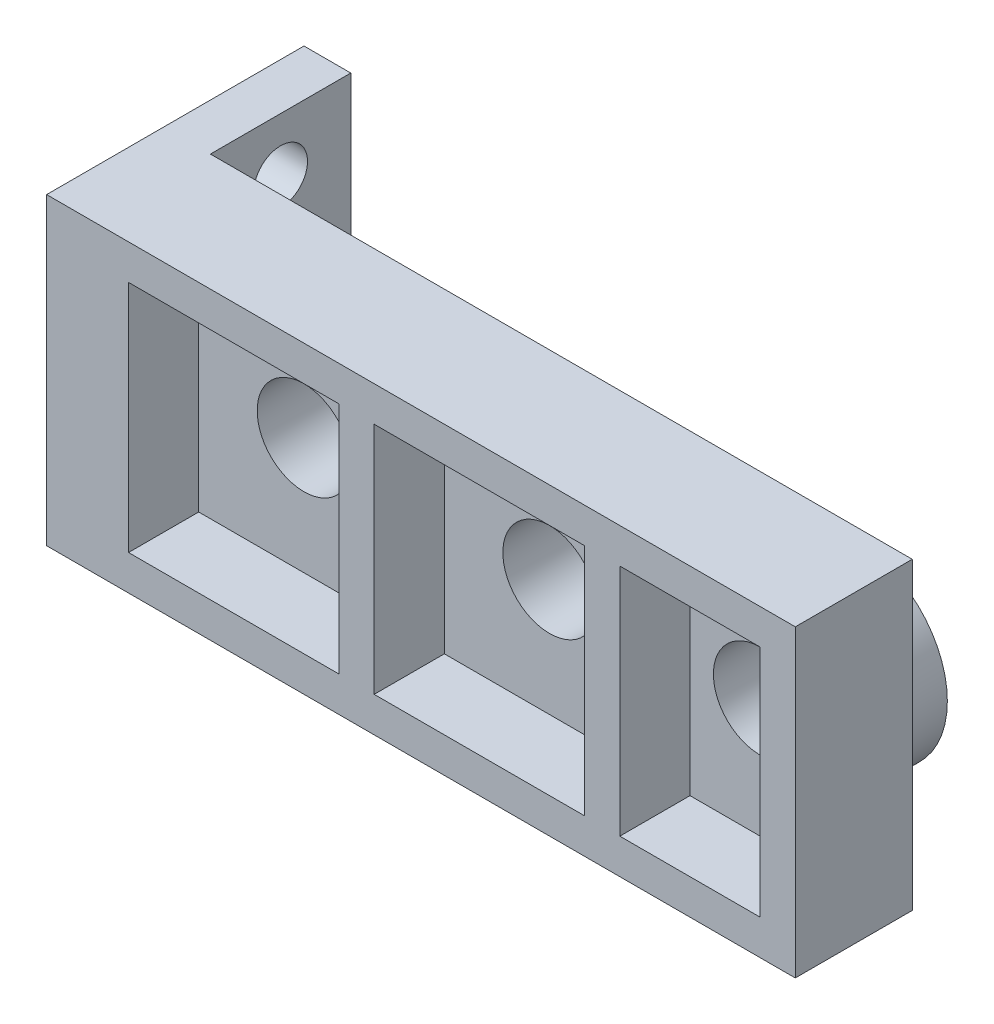
ISO-10303-21;
HEADER;
FILE_DESCRIPTION(('STEP AP214'),'2;1');
FILE_NAME('part.step','',(''),(''),'','','');
FILE_SCHEMA(('AUTOMOTIVE_DESIGN { 1 0 10303 214 1 1 1 1 }'));
ENDSEC;
DATA;
#1=APPLICATION_CONTEXT('core data for automotive mechanical design processes');
#2=APPLICATION_PROTOCOL_DEFINITION('international standard','automotive_design',2000,#1);
#3=PRODUCT_CONTEXT('',#1,'mechanical');
#4=PRODUCT('Part','Part','',(#3));
#5=PRODUCT_RELATED_PRODUCT_CATEGORY('part','',(#4));
#6=PRODUCT_DEFINITION_FORMATION('','',#4);
#7=PRODUCT_DEFINITION_CONTEXT('part definition',#1,'design');
#8=PRODUCT_DEFINITION('design','',#6,#7);
#9=PRODUCT_DEFINITION_SHAPE('','',#8);
#10=(LENGTH_UNIT() NAMED_UNIT(*) SI_UNIT(.MILLI.,.METRE.));
#11=(NAMED_UNIT(*) PLANE_ANGLE_UNIT() SI_UNIT($,.RADIAN.));
#12=(NAMED_UNIT(*) SI_UNIT($,.STERADIAN.) SOLID_ANGLE_UNIT());
#13=UNCERTAINTY_MEASURE_WITH_UNIT(LENGTH_MEASURE(1.E-05),#10,'distance_accuracy_value','');
#14=(GEOMETRIC_REPRESENTATION_CONTEXT(3) GLOBAL_UNCERTAINTY_ASSIGNED_CONTEXT((#13)) GLOBAL_UNIT_ASSIGNED_CONTEXT((#10,
#11,#12)) REPRESENTATION_CONTEXT('',''));
#15=CARTESIAN_POINT('',(0.,0.,0.));
#16=DIRECTION('',(0.,0.,1.));
#17=DIRECTION('',(1.,0.,0.));
#18=AXIS2_PLACEMENT_3D('',#15,#16,#17);
#19=CARTESIAN_POINT('',(0.,0.,0.));
#20=DIRECTION('',(0.,0.,1.));
#21=DIRECTION('',(1.,0.,0.));
#22=AXIS2_PLACEMENT_3D('',#19,#20,#21);
#23=PLANE('',#22);
#24=CARTESIAN_POINT('',(1.5,0.,0.));
#25=DIRECTION('',(0.,0.,1.));
#26=DIRECTION('',(1.,0.,0.));
#27=AXIS2_PLACEMENT_3D('',#24,#25,#26);
#28=CIRCLE('',#27,4.);
#29=CARTESIAN_POINT('',(5.5,0.,0.));
#30=VERTEX_POINT('',#29);
#31=EDGE_CURVE('E44',#30,#30,#28,.F.);
#32=ORIENTED_EDGE('',*,*,#31,.F.);
#33=EDGE_LOOP('',(#32));
#34=FACE_BOUND('',#33,.T.);
#35=DIRECTION('',(0.,1.,0.));
#36=VECTOR('',#35,1.);
#37=CARTESIAN_POINT('',(15.,6.5,0.));
#38=LINE('',#37,#36);
#39=CARTESIAN_POINT('',(15.,-6.5,0.));
#40=VERTEX_POINT('',#39);
#41=CARTESIAN_POINT('',(15.,6.5,0.));
#42=VERTEX_POINT('',#41);
#43=EDGE_CURVE('E241',#40,#42,#38,.T.);
#44=ORIENTED_EDGE('',*,*,#43,.F.);
#45=DIRECTION('',(1.,0.,0.));
#46=VECTOR('',#45,1.);
#47=CARTESIAN_POINT('',(-15.,-6.5,0.));
#48=LINE('',#47,#46);
#49=CARTESIAN_POINT('',(-15.,-6.5,0.));
#50=VERTEX_POINT('',#49);
#51=EDGE_CURVE('E307',#50,#40,#48,.T.);
#52=ORIENTED_EDGE('',*,*,#51,.F.);
#53=DIRECTION('',(0.,-1.,0.));
#54=VECTOR('',#53,1.);
#55=CARTESIAN_POINT('',(-15.,6.5,0.));
#56=LINE('',#55,#54);
#57=CARTESIAN_POINT('',(-15.,6.5,0.));
#58=VERTEX_POINT('',#57);
#59=EDGE_CURVE('E315',#58,#50,#56,.T.);
#60=ORIENTED_EDGE('',*,*,#59,.F.);
#61=DIRECTION('',(-1.,0.,0.));
#62=VECTOR('',#61,1.);
#63=CARTESIAN_POINT('',(-15.,6.5,0.));
#64=LINE('',#63,#62);
#65=EDGE_CURVE('E313',#42,#58,#64,.T.);
#66=ORIENTED_EDGE('',*,*,#65,.F.);
#67=EDGE_LOOP('',(#44,#52,#60,#66));
#68=FACE_BOUND('',#67,.T.);
#69=CARTESIAN_POINT('',(10.5,0.,0.));
#70=DIRECTION('',(0.,0.,1.));
#71=DIRECTION('',(1.,0.,0.));
#72=AXIS2_PLACEMENT_3D('',#69,#70,#71);
#73=CIRCLE('',#72,4.);
#74=CARTESIAN_POINT('',(14.5,0.,0.));
#75=VERTEX_POINT('',#74);
#76=EDGE_CURVE('E323',#75,#75,#73,.F.);
#77=ORIENTED_EDGE('',*,*,#76,.F.);
#78=EDGE_LOOP('',(#77));
#79=FACE_BOUND('',#78,.T.);
#80=CARTESIAN_POINT('',(-9.,0.,0.));
#81=DIRECTION('',(0.,0.,1.));
#82=DIRECTION('',(1.,0.,0.));
#83=AXIS2_PLACEMENT_3D('',#80,#81,#82);
#84=CIRCLE('',#83,4.);
#85=CARTESIAN_POINT('',(-5.,0.,0.));
#86=VERTEX_POINT('',#85);
#87=EDGE_CURVE('E11',#86,#86,#84,.F.);
#88=ORIENTED_EDGE('',*,*,#87,.F.);
#89=EDGE_LOOP('',(#88));
#90=FACE_BOUND('',#89,.T.);
#91=ADVANCED_FACE('F36',(#34,#68,#79,#90),#23,.F.);
#92=CARTESIAN_POINT('',(15.,6.5,5.));
#93=DIRECTION('',(-1.,0.,0.));
#94=DIRECTION('',(0.,0.,1.));
#95=AXIS2_PLACEMENT_3D('',#92,#93,#94);
#96=PLANE('',#95);
#97=ORIENTED_EDGE('',*,*,#43,.T.);
#98=DIRECTION('',(0.,0.,-1.));
#99=VECTOR('',#98,1.);
#100=CARTESIAN_POINT('',(15.,6.5,5.));
#101=LINE('',#100,#99);
#102=CARTESIAN_POINT('',(15.,6.5,5.));
#103=VERTEX_POINT('',#102);
#104=EDGE_CURVE('E321',#103,#42,#101,.T.);
#105=ORIENTED_EDGE('',*,*,#104,.F.);
#106=DIRECTION('',(0.,1.,0.));
#107=VECTOR('',#106,1.);
#108=CARTESIAN_POINT('',(15.,6.5,5.));
#109=LINE('',#108,#107);
#110=CARTESIAN_POINT('',(15.,-6.5,5.));
#111=VERTEX_POINT('',#110);
#112=EDGE_CURVE('E167',#111,#103,#109,.T.);
#113=ORIENTED_EDGE('',*,*,#112,.F.);
#114=DIRECTION('',(0.,0.,-1.));
#115=VECTOR('',#114,1.);
#116=CARTESIAN_POINT('',(15.,-6.5,5.));
#117=LINE('',#116,#115);
#118=EDGE_CURVE('E310',#111,#40,#117,.T.);
#119=ORIENTED_EDGE('',*,*,#118,.T.);
#120=EDGE_LOOP('',(#97,#105,#113,#119));
#121=FACE_BOUND('',#120,.T.);
#122=ADVANCED_FACE('F38',(#121),#96,.F.);
#123=CARTESIAN_POINT('',(-15.,6.5,5.));
#124=DIRECTION('',(0.,-1.,0.));
#125=DIRECTION('',(0.,0.,-1.));
#126=AXIS2_PLACEMENT_3D('',#123,#124,#125);
#127=PLANE('',#126);
#128=ORIENTED_EDGE('',*,*,#65,.T.);
#129=DIRECTION('',(0.,0.,-1.));
#130=VECTOR('',#129,1.);
#131=CARTESIAN_POINT('',(-15.,6.5,5.));
#132=LINE('',#131,#130);
#133=CARTESIAN_POINT('',(-15.,6.5,-6.));
#134=VERTEX_POINT('',#133);
#135=EDGE_CURVE('E198',#58,#134,#132,.T.);
#136=ORIENTED_EDGE('',*,*,#135,.T.);
#137=DIRECTION('',(1.,0.,0.));
#138=VECTOR('',#137,1.);
#139=CARTESIAN_POINT('',(-17.,6.5,-6.));
#140=LINE('',#139,#138);
#141=CARTESIAN_POINT('',(-17.,6.5,-6.));
#142=VERTEX_POINT('',#141);
#143=EDGE_CURVE('E177',#142,#134,#140,.T.);
#144=ORIENTED_EDGE('',*,*,#143,.F.);
#145=DIRECTION('',(0.,0.,-1.));
#146=VECTOR('',#145,1.);
#147=CARTESIAN_POINT('',(-17.,6.5,5.));
#148=LINE('',#147,#146);
#149=CARTESIAN_POINT('',(-17.,6.5,5.));
#150=VERTEX_POINT('',#149);
#151=EDGE_CURVE('E174',#150,#142,#148,.T.);
#152=ORIENTED_EDGE('',*,*,#151,.F.);
#153=DIRECTION('',(-1.,0.,0.));
#154=VECTOR('',#153,1.);
#155=CARTESIAN_POINT('',(-15.,6.5,5.));
#156=LINE('',#155,#154);
#157=EDGE_CURVE('E161',#103,#150,#156,.T.);
#158=ORIENTED_EDGE('',*,*,#157,.F.);
#159=ORIENTED_EDGE('',*,*,#104,.T.);
#160=EDGE_LOOP('',(#128,#136,#144,#152,#158,#159));
#161=FACE_BOUND('',#160,.T.);
#162=ADVANCED_FACE('F175',(#161),#127,.F.);
#163=CARTESIAN_POINT('',(-15.,-6.5,5.));
#164=DIRECTION('',(0.,1.,0.));
#165=DIRECTION('',(0.,0.,1.));
#166=AXIS2_PLACEMENT_3D('',#163,#164,#165);
#167=PLANE('',#166);
#168=ORIENTED_EDGE('',*,*,#51,.T.);
#169=ORIENTED_EDGE('',*,*,#118,.F.);
#170=DIRECTION('',(1.,0.,0.));
#171=VECTOR('',#170,1.);
#172=CARTESIAN_POINT('',(-15.,-6.5,5.));
#173=LINE('',#172,#171);
#174=CARTESIAN_POINT('',(-17.,-6.5,5.));
#175=VERTEX_POINT('',#174);
#176=EDGE_CURVE('E171',#175,#111,#173,.T.);
#177=ORIENTED_EDGE('',*,*,#176,.F.);
#178=DIRECTION('',(0.,0.,1.));
#179=VECTOR('',#178,1.);
#180=CARTESIAN_POINT('',(-17.,-6.5,5.));
#181=LINE('',#180,#179);
#182=CARTESIAN_POINT('',(-17.,-6.5,-6.));
#183=VERTEX_POINT('',#182);
#184=EDGE_CURVE('E185',#183,#175,#181,.T.);
#185=ORIENTED_EDGE('',*,*,#184,.F.);
#186=DIRECTION('',(1.,0.,0.));
#187=VECTOR('',#186,1.);
#188=CARTESIAN_POINT('',(-17.,-6.5,-6.));
#189=LINE('',#188,#187);
#190=CARTESIAN_POINT('',(-15.,-6.5,-6.));
#191=VERTEX_POINT('',#190);
#192=EDGE_CURVE('E197',#183,#191,#189,.T.);
#193=ORIENTED_EDGE('',*,*,#192,.T.);
#194=DIRECTION('',(0.,0.,1.));
#195=VECTOR('',#194,1.);
#196=CARTESIAN_POINT('',(-15.,-6.5,5.));
#197=LINE('',#196,#195);
#198=EDGE_CURVE('E186',#191,#50,#197,.T.);
#199=ORIENTED_EDGE('',*,*,#198,.T.);
#200=EDGE_LOOP('',(#168,#169,#177,#185,#193,#199));
#201=FACE_BOUND('',#200,.T.);
#202=ADVANCED_FACE('F456',(#201),#167,.F.);
#203=CARTESIAN_POINT('',(0.,0.,5.));
#204=DIRECTION('',(0.,0.,1.));
#205=DIRECTION('',(1.,0.,0.));
#206=AXIS2_PLACEMENT_3D('',#203,#204,#205);
#207=PLANE('',#206);
#208=DIRECTION('',(0.,-1.,0.));
#209=VECTOR('',#208,1.);
#210=CARTESIAN_POINT('',(-13.5,5.,5.));
#211=LINE('',#210,#209);
#212=CARTESIAN_POINT('',(-13.5,5.,5.));
#213=VERTEX_POINT('',#212);
#214=CARTESIAN_POINT('',(-13.5,-5.,5.));
#215=VERTEX_POINT('',#214);
#216=EDGE_CURVE('E51',#213,#215,#211,.T.);
#217=ORIENTED_EDGE('',*,*,#216,.F.);
#218=DIRECTION('',(-1.,0.,0.));
#219=VECTOR('',#218,1.);
#220=CARTESIAN_POINT('',(-13.5,5.,5.));
#221=LINE('',#220,#219);
#222=CARTESIAN_POINT('',(-4.5,5.,5.));
#223=VERTEX_POINT('',#222);
#224=EDGE_CURVE('E219',#223,#213,#221,.T.);
#225=ORIENTED_EDGE('',*,*,#224,.F.);
#226=DIRECTION('',(0.,1.,0.));
#227=VECTOR('',#226,1.);
#228=CARTESIAN_POINT('',(-4.5,5.,5.));
#229=LINE('',#228,#227);
#230=CARTESIAN_POINT('',(-4.5,-5.,5.));
#231=VERTEX_POINT('',#230);
#232=EDGE_CURVE('E234',#231,#223,#229,.T.);
#233=ORIENTED_EDGE('',*,*,#232,.F.);
#234=DIRECTION('',(1.,0.,0.));
#235=VECTOR('',#234,1.);
#236=CARTESIAN_POINT('',(-13.5,-5.,5.));
#237=LINE('',#236,#235);
#238=EDGE_CURVE('E230',#215,#231,#237,.T.);
#239=ORIENTED_EDGE('',*,*,#238,.F.);
#240=EDGE_LOOP('',(#217,#225,#233,#239));
#241=FACE_BOUND('',#240,.T.);
#242=DIRECTION('',(0.,-1.,0.));
#243=VECTOR('',#242,1.);
#244=CARTESIAN_POINT('',(-3.,5.,5.));
#245=LINE('',#244,#243);
#246=CARTESIAN_POINT('',(-3.,5.,5.));
#247=VERTEX_POINT('',#246);
#248=CARTESIAN_POINT('',(-3.,-5.,5.));
#249=VERTEX_POINT('',#248);
#250=EDGE_CURVE('E59',#247,#249,#245,.T.);
#251=ORIENTED_EDGE('',*,*,#250,.F.);
#252=DIRECTION('',(-1.,0.,0.));
#253=VECTOR('',#252,1.);
#254=CARTESIAN_POINT('',(-3.,5.,5.));
#255=LINE('',#254,#253);
#256=CARTESIAN_POINT('',(6.,5.,5.));
#257=VERTEX_POINT('',#256);
#258=EDGE_CURVE('E251',#257,#247,#255,.T.);
#259=ORIENTED_EDGE('',*,*,#258,.F.);
#260=DIRECTION('',(0.,1.,0.));
#261=VECTOR('',#260,1.);
#262=CARTESIAN_POINT('',(6.,5.,5.));
#263=LINE('',#262,#261);
#264=CARTESIAN_POINT('',(6.,-5.,5.));
#265=VERTEX_POINT('',#264);
#266=EDGE_CURVE('E266',#265,#257,#263,.T.);
#267=ORIENTED_EDGE('',*,*,#266,.F.);
#268=DIRECTION('',(1.,0.,0.));
#269=VECTOR('',#268,1.);
#270=CARTESIAN_POINT('',(-3.,-5.,5.));
#271=LINE('',#270,#269);
#272=EDGE_CURVE('E262',#249,#265,#271,.T.);
#273=ORIENTED_EDGE('',*,*,#272,.F.);
#274=EDGE_LOOP('',(#251,#259,#267,#273));
#275=FACE_BOUND('',#274,.T.);
#276=DIRECTION('',(0.,-1.,0.));
#277=VECTOR('',#276,1.);
#278=CARTESIAN_POINT('',(7.5,5.,5.));
#279=LINE('',#278,#277);
#280=CARTESIAN_POINT('',(7.5,5.,5.));
#281=VERTEX_POINT('',#280);
#282=CARTESIAN_POINT('',(7.5,-5.,5.));
#283=VERTEX_POINT('',#282);
#284=EDGE_CURVE('E209',#281,#283,#279,.T.);
#285=ORIENTED_EDGE('',*,*,#284,.F.);
#286=DIRECTION('',(-1.,0.,0.));
#287=VECTOR('',#286,1.);
#288=CARTESIAN_POINT('',(7.5,5.,5.));
#289=LINE('',#288,#287);
#290=CARTESIAN_POINT('',(13.5,5.,5.));
#291=VERTEX_POINT('',#290);
#292=EDGE_CURVE('E281',#291,#281,#289,.T.);
#293=ORIENTED_EDGE('',*,*,#292,.F.);
#294=DIRECTION('',(0.,1.,0.));
#295=VECTOR('',#294,1.);
#296=CARTESIAN_POINT('',(13.5,5.,5.));
#297=LINE('',#296,#295);
#298=CARTESIAN_POINT('',(13.5,-5.,5.));
#299=VERTEX_POINT('',#298);
#300=EDGE_CURVE('E295',#299,#291,#297,.T.);
#301=ORIENTED_EDGE('',*,*,#300,.F.);
#302=DIRECTION('',(1.,0.,0.));
#303=VECTOR('',#302,1.);
#304=CARTESIAN_POINT('',(7.5,-5.,5.));
#305=LINE('',#304,#303);
#306=EDGE_CURVE('E292',#283,#299,#305,.T.);
#307=ORIENTED_EDGE('',*,*,#306,.F.);
#308=EDGE_LOOP('',(#285,#293,#301,#307));
#309=FACE_BOUND('',#308,.T.);
#310=ORIENTED_EDGE('',*,*,#112,.T.);
#311=ORIENTED_EDGE('',*,*,#157,.T.);
#312=DIRECTION('',(0.,1.,0.));
#313=VECTOR('',#312,1.);
#314=CARTESIAN_POINT('',(-17.,6.5,5.));
#315=LINE('',#314,#313);
#316=EDGE_CURVE('E165',#175,#150,#315,.T.);
#317=ORIENTED_EDGE('',*,*,#316,.F.);
#318=ORIENTED_EDGE('',*,*,#176,.T.);
#319=EDGE_LOOP('',(#310,#311,#317,#318));
#320=FACE_BOUND('',#319,.T.);
#321=ADVANCED_FACE('F163',(#241,#275,#309,#320),#207,.T.);
#322=CARTESIAN_POINT('',(7.5,5.,2.));
#323=DIRECTION('',(-1.,0.,0.));
#324=DIRECTION('',(0.,-1.,0.));
#325=AXIS2_PLACEMENT_3D('',#322,#323,#324);
#326=PLANE('',#325);
#327=ORIENTED_EDGE('',*,*,#284,.T.);
#328=DIRECTION('',(0.,0.,1.));
#329=VECTOR('',#328,1.);
#330=CARTESIAN_POINT('',(7.5,-5.,2.));
#331=LINE('',#330,#329);
#332=CARTESIAN_POINT('',(7.5,-5.,2.));
#333=VERTEX_POINT('',#332);
#334=EDGE_CURVE('E290',#333,#283,#331,.T.);
#335=ORIENTED_EDGE('',*,*,#334,.F.);
#336=DIRECTION('',(0.,-1.,0.));
#337=VECTOR('',#336,1.);
#338=CARTESIAN_POINT('',(7.5,5.,2.));
#339=LINE('',#338,#337);
#340=CARTESIAN_POINT('',(7.5,5.,2.));
#341=VERTEX_POINT('',#340);
#342=EDGE_CURVE('E277',#341,#333,#339,.T.);
#343=ORIENTED_EDGE('',*,*,#342,.F.);
#344=DIRECTION('',(0.,0.,1.));
#345=VECTOR('',#344,1.);
#346=CARTESIAN_POINT('',(7.5,5.,2.));
#347=LINE('',#346,#345);
#348=EDGE_CURVE('E263',#341,#281,#347,.T.);
#349=ORIENTED_EDGE('',*,*,#348,.T.);
#350=EDGE_LOOP('',(#327,#335,#343,#349));
#351=FACE_BOUND('',#350,.T.);
#352=ADVANCED_FACE('F444',(#351),#326,.F.);
#353=CARTESIAN_POINT('',(7.5,5.,2.));
#354=DIRECTION('',(0.,1.,0.));
#355=DIRECTION('',(0.,0.,1.));
#356=AXIS2_PLACEMENT_3D('',#353,#354,#355);
#357=PLANE('',#356);
#358=ORIENTED_EDGE('',*,*,#292,.T.);
#359=ORIENTED_EDGE('',*,*,#348,.F.);
#360=DIRECTION('',(-1.,0.,0.));
#361=VECTOR('',#360,1.);
#362=CARTESIAN_POINT('',(7.5,5.,2.));
#363=LINE('',#362,#361);
#364=CARTESIAN_POINT('',(13.5,5.,2.));
#365=VERTEX_POINT('',#364);
#366=EDGE_CURVE('E287',#365,#341,#363,.T.);
#367=ORIENTED_EDGE('',*,*,#366,.F.);
#368=DIRECTION('',(0.,0.,1.));
#369=VECTOR('',#368,1.);
#370=CARTESIAN_POINT('',(13.5,5.,2.));
#371=LINE('',#370,#369);
#372=EDGE_CURVE('E301',#365,#291,#371,.T.);
#373=ORIENTED_EDGE('',*,*,#372,.T.);
#374=EDGE_LOOP('',(#358,#359,#367,#373));
#375=FACE_BOUND('',#374,.T.);
#376=ADVANCED_FACE('F440',(#375),#357,.F.);
#377=CARTESIAN_POINT('',(13.5,5.,2.));
#378=DIRECTION('',(1.,0.,0.));
#379=DIRECTION('',(0.,1.,0.));
#380=AXIS2_PLACEMENT_3D('',#377,#378,#379);
#381=PLANE('',#380);
#382=ORIENTED_EDGE('',*,*,#300,.T.);
#383=ORIENTED_EDGE('',*,*,#372,.F.);
#384=DIRECTION('',(0.,1.,0.));
#385=VECTOR('',#384,1.);
#386=CARTESIAN_POINT('',(13.5,5.,2.));
#387=LINE('',#386,#385);
#388=CARTESIAN_POINT('',(13.5,-5.,2.));
#389=VERTEX_POINT('',#388);
#390=EDGE_CURVE('E284',#389,#365,#387,.T.);
#391=ORIENTED_EDGE('',*,*,#390,.F.);
#392=DIRECTION('',(0.,0.,1.));
#393=VECTOR('',#392,1.);
#394=CARTESIAN_POINT('',(13.5,-5.,2.));
#395=LINE('',#394,#393);
#396=EDGE_CURVE('E303',#389,#299,#395,.T.);
#397=ORIENTED_EDGE('',*,*,#396,.T.);
#398=EDGE_LOOP('',(#382,#383,#391,#397));
#399=FACE_BOUND('',#398,.T.);
#400=ADVANCED_FACE('F443',(#399),#381,.F.);
#401=CARTESIAN_POINT('',(7.5,-5.,2.));
#402=DIRECTION('',(0.,-1.,0.));
#403=DIRECTION('',(0.,0.,-1.));
#404=AXIS2_PLACEMENT_3D('',#401,#402,#403);
#405=PLANE('',#404);
#406=ORIENTED_EDGE('',*,*,#306,.T.);
#407=ORIENTED_EDGE('',*,*,#396,.F.);
#408=DIRECTION('',(1.,0.,0.));
#409=VECTOR('',#408,1.);
#410=CARTESIAN_POINT('',(7.5,-5.,2.));
#411=LINE('',#410,#409);
#412=EDGE_CURVE('E280',#333,#389,#411,.T.);
#413=ORIENTED_EDGE('',*,*,#412,.F.);
#414=ORIENTED_EDGE('',*,*,#334,.T.);
#415=EDGE_LOOP('',(#406,#407,#413,#414));
#416=FACE_BOUND('',#415,.T.);
#417=ADVANCED_FACE('F438',(#416),#405,.F.);
#418=CARTESIAN_POINT('',(0.,0.,2.));
#419=DIRECTION('',(0.,0.,1.));
#420=DIRECTION('',(1.,0.,0.));
#421=AXIS2_PLACEMENT_3D('',#418,#419,#420);
#422=PLANE('',#421);
#423=CARTESIAN_POINT('',(10.5,0.,2.));
#424=DIRECTION('',(0.,0.,1.));
#425=DIRECTION('',(1.,0.,0.));
#426=AXIS2_PLACEMENT_3D('',#423,#424,#425);
#427=CIRCLE('',#426,2.);
#428=CARTESIAN_POINT('',(12.5,0.,2.));
#429=VERTEX_POINT('',#428);
#430=EDGE_CURVE('E205',#429,#429,#427,.T.);
#431=ORIENTED_EDGE('',*,*,#430,.F.);
#432=EDGE_LOOP('',(#431));
#433=FACE_BOUND('',#432,.T.);
#434=ORIENTED_EDGE('',*,*,#342,.T.);
#435=ORIENTED_EDGE('',*,*,#412,.T.);
#436=ORIENTED_EDGE('',*,*,#390,.T.);
#437=ORIENTED_EDGE('',*,*,#366,.T.);
#438=EDGE_LOOP('',(#434,#435,#436,#437));
#439=FACE_BOUND('',#438,.T.);
#440=ADVANCED_FACE('F435',(#433,#439),#422,.T.);
#441=CARTESIAN_POINT('',(-3.,5.,2.));
#442=DIRECTION('',(-1.,0.,0.));
#443=DIRECTION('',(0.,-1.,0.));
#444=AXIS2_PLACEMENT_3D('',#441,#442,#443);
#445=PLANE('',#444);
#446=ORIENTED_EDGE('',*,*,#250,.T.);
#447=DIRECTION('',(0.,0.,1.));
#448=VECTOR('',#447,1.);
#449=CARTESIAN_POINT('',(-3.,-5.,2.));
#450=LINE('',#449,#448);
#451=CARTESIAN_POINT('',(-3.,-5.,2.));
#452=VERTEX_POINT('',#451);
#453=EDGE_CURVE('E260',#452,#249,#450,.T.);
#454=ORIENTED_EDGE('',*,*,#453,.F.);
#455=DIRECTION('',(0.,-1.,0.));
#456=VECTOR('',#455,1.);
#457=CARTESIAN_POINT('',(-3.,5.,2.));
#458=LINE('',#457,#456);
#459=CARTESIAN_POINT('',(-3.,5.,2.));
#460=VERTEX_POINT('',#459);
#461=EDGE_CURVE('E247',#460,#452,#458,.T.);
#462=ORIENTED_EDGE('',*,*,#461,.F.);
#463=DIRECTION('',(0.,0.,1.));
#464=VECTOR('',#463,1.);
#465=CARTESIAN_POINT('',(-3.,5.,2.));
#466=LINE('',#465,#464);
#467=EDGE_CURVE('E231',#460,#247,#466,.T.);
#468=ORIENTED_EDGE('',*,*,#467,.T.);
#469=EDGE_LOOP('',(#446,#454,#462,#468));
#470=FACE_BOUND('',#469,.T.);
#471=ADVANCED_FACE('F425',(#470),#445,.F.);
#472=CARTESIAN_POINT('',(-3.,5.,2.));
#473=DIRECTION('',(0.,1.,0.));
#474=DIRECTION('',(0.,0.,1.));
#475=AXIS2_PLACEMENT_3D('',#472,#473,#474);
#476=PLANE('',#475);
#477=ORIENTED_EDGE('',*,*,#258,.T.);
#478=ORIENTED_EDGE('',*,*,#467,.F.);
#479=DIRECTION('',(-1.,0.,0.));
#480=VECTOR('',#479,1.);
#481=CARTESIAN_POINT('',(-3.,5.,2.));
#482=LINE('',#481,#480);
#483=CARTESIAN_POINT('',(6.,5.,2.));
#484=VERTEX_POINT('',#483);
#485=EDGE_CURVE('E257',#484,#460,#482,.T.);
#486=ORIENTED_EDGE('',*,*,#485,.F.);
#487=DIRECTION('',(0.,0.,1.));
#488=VECTOR('',#487,1.);
#489=CARTESIAN_POINT('',(6.,5.,2.));
#490=LINE('',#489,#488);
#491=EDGE_CURVE('E272',#484,#257,#490,.T.);
#492=ORIENTED_EDGE('',*,*,#491,.T.);
#493=EDGE_LOOP('',(#477,#478,#486,#492));
#494=FACE_BOUND('',#493,.T.);
#495=ADVANCED_FACE('F421',(#494),#476,.F.);
#496=CARTESIAN_POINT('',(6.,5.,2.));
#497=DIRECTION('',(1.,0.,0.));
#498=DIRECTION('',(0.,1.,0.));
#499=AXIS2_PLACEMENT_3D('',#496,#497,#498);
#500=PLANE('',#499);
#501=ORIENTED_EDGE('',*,*,#266,.T.);
#502=ORIENTED_EDGE('',*,*,#491,.F.);
#503=DIRECTION('',(0.,1.,0.));
#504=VECTOR('',#503,1.);
#505=CARTESIAN_POINT('',(6.,5.,2.));
#506=LINE('',#505,#504);
#507=CARTESIAN_POINT('',(6.,-5.,2.));
#508=VERTEX_POINT('',#507);
#509=EDGE_CURVE('E254',#508,#484,#506,.T.);
#510=ORIENTED_EDGE('',*,*,#509,.F.);
#511=DIRECTION('',(0.,0.,1.));
#512=VECTOR('',#511,1.);
#513=CARTESIAN_POINT('',(6.,-5.,2.));
#514=LINE('',#513,#512);
#515=EDGE_CURVE('E274',#508,#265,#514,.T.);
#516=ORIENTED_EDGE('',*,*,#515,.T.);
#517=EDGE_LOOP('',(#501,#502,#510,#516));
#518=FACE_BOUND('',#517,.T.);
#519=ADVANCED_FACE('F424',(#518),#500,.F.);
#520=CARTESIAN_POINT('',(-3.,-5.,2.));
#521=DIRECTION('',(0.,-1.,0.));
#522=DIRECTION('',(0.,0.,-1.));
#523=AXIS2_PLACEMENT_3D('',#520,#521,#522);
#524=PLANE('',#523);
#525=ORIENTED_EDGE('',*,*,#272,.T.);
#526=ORIENTED_EDGE('',*,*,#515,.F.);
#527=DIRECTION('',(1.,0.,0.));
#528=VECTOR('',#527,1.);
#529=CARTESIAN_POINT('',(-3.,-5.,2.));
#530=LINE('',#529,#528);
#531=EDGE_CURVE('E250',#452,#508,#530,.T.);
#532=ORIENTED_EDGE('',*,*,#531,.F.);
#533=ORIENTED_EDGE('',*,*,#453,.T.);
#534=EDGE_LOOP('',(#525,#526,#532,#533));
#535=FACE_BOUND('',#534,.T.);
#536=ADVANCED_FACE('F419',(#535),#524,.F.);
#537=CARTESIAN_POINT('',(0.,0.,2.));
#538=DIRECTION('',(0.,0.,1.));
#539=DIRECTION('',(1.,0.,0.));
#540=AXIS2_PLACEMENT_3D('',#537,#538,#539);
#541=PLANE('',#540);
#542=CARTESIAN_POINT('',(1.5,0.,2.));
#543=DIRECTION('',(0.,0.,1.));
#544=DIRECTION('',(1.,0.,0.));
#545=AXIS2_PLACEMENT_3D('',#542,#543,#544);
#546=CIRCLE('',#545,2.);
#547=CARTESIAN_POINT('',(3.5,0.,2.));
#548=VERTEX_POINT('',#547);
#549=EDGE_CURVE('E210',#548,#548,#546,.T.);
#550=ORIENTED_EDGE('',*,*,#549,.F.);
#551=EDGE_LOOP('',(#550));
#552=FACE_BOUND('',#551,.T.);
#553=ORIENTED_EDGE('',*,*,#461,.T.);
#554=ORIENTED_EDGE('',*,*,#531,.T.);
#555=ORIENTED_EDGE('',*,*,#509,.T.);
#556=ORIENTED_EDGE('',*,*,#485,.T.);
#557=EDGE_LOOP('',(#553,#554,#555,#556));
#558=FACE_BOUND('',#557,.T.);
#559=ADVANCED_FACE('F416',(#552,#558),#541,.T.);
#560=CARTESIAN_POINT('',(-13.5,5.,2.));
#561=DIRECTION('',(-1.,0.,0.));
#562=DIRECTION('',(0.,-1.,0.));
#563=AXIS2_PLACEMENT_3D('',#560,#561,#562);
#564=PLANE('',#563);
#565=ORIENTED_EDGE('',*,*,#216,.T.);
#566=DIRECTION('',(0.,0.,1.));
#567=VECTOR('',#566,1.);
#568=CARTESIAN_POINT('',(-13.5,-5.,2.));
#569=LINE('',#568,#567);
#570=CARTESIAN_POINT('',(-13.5,-5.,2.));
#571=VERTEX_POINT('',#570);
#572=EDGE_CURVE('E228',#571,#215,#569,.T.);
#573=ORIENTED_EDGE('',*,*,#572,.F.);
#574=DIRECTION('',(0.,-1.,0.));
#575=VECTOR('',#574,1.);
#576=CARTESIAN_POINT('',(-13.5,5.,2.));
#577=LINE('',#576,#575);
#578=CARTESIAN_POINT('',(-13.5,5.,2.));
#579=VERTEX_POINT('',#578);
#580=EDGE_CURVE('E215',#579,#571,#577,.T.);
#581=ORIENTED_EDGE('',*,*,#580,.F.);
#582=DIRECTION('',(0.,0.,1.));
#583=VECTOR('',#582,1.);
#584=CARTESIAN_POINT('',(-13.5,5.,2.));
#585=LINE('',#584,#583);
#586=EDGE_CURVE('E239',#579,#213,#585,.T.);
#587=ORIENTED_EDGE('',*,*,#586,.T.);
#588=EDGE_LOOP('',(#565,#573,#581,#587));
#589=FACE_BOUND('',#588,.T.);
#590=ADVANCED_FACE('F406',(#589),#564,.F.);
#591=CARTESIAN_POINT('',(-13.5,5.,2.));
#592=DIRECTION('',(0.,1.,0.));
#593=DIRECTION('',(0.,0.,1.));
#594=AXIS2_PLACEMENT_3D('',#591,#592,#593);
#595=PLANE('',#594);
#596=ORIENTED_EDGE('',*,*,#224,.T.);
#597=ORIENTED_EDGE('',*,*,#586,.F.);
#598=DIRECTION('',(-1.,0.,0.));
#599=VECTOR('',#598,1.);
#600=CARTESIAN_POINT('',(-13.5,5.,2.));
#601=LINE('',#600,#599);
#602=CARTESIAN_POINT('',(-4.5,5.,2.));
#603=VERTEX_POINT('',#602);
#604=EDGE_CURVE('E225',#603,#579,#601,.T.);
#605=ORIENTED_EDGE('',*,*,#604,.F.);
#606=DIRECTION('',(0.,0.,1.));
#607=VECTOR('',#606,1.);
#608=CARTESIAN_POINT('',(-4.5,5.,2.));
#609=LINE('',#608,#607);
#610=EDGE_CURVE('E242',#603,#223,#609,.T.);
#611=ORIENTED_EDGE('',*,*,#610,.T.);
#612=EDGE_LOOP('',(#596,#597,#605,#611));
#613=FACE_BOUND('',#612,.T.);
#614=ADVANCED_FACE('F402',(#613),#595,.F.);
#615=CARTESIAN_POINT('',(-4.5,5.,2.));
#616=DIRECTION('',(1.,0.,0.));
#617=DIRECTION('',(0.,1.,0.));
#618=AXIS2_PLACEMENT_3D('',#615,#616,#617);
#619=PLANE('',#618);
#620=ORIENTED_EDGE('',*,*,#232,.T.);
#621=ORIENTED_EDGE('',*,*,#610,.F.);
#622=DIRECTION('',(0.,1.,0.));
#623=VECTOR('',#622,1.);
#624=CARTESIAN_POINT('',(-4.5,5.,2.));
#625=LINE('',#624,#623);
#626=CARTESIAN_POINT('',(-4.5,-5.,2.));
#627=VERTEX_POINT('',#626);
#628=EDGE_CURVE('E222',#627,#603,#625,.T.);
#629=ORIENTED_EDGE('',*,*,#628,.F.);
#630=DIRECTION('',(0.,0.,1.));
#631=VECTOR('',#630,1.);
#632=CARTESIAN_POINT('',(-4.5,-5.,2.));
#633=LINE('',#632,#631);
#634=EDGE_CURVE('E244',#627,#231,#633,.T.);
#635=ORIENTED_EDGE('',*,*,#634,.T.);
#636=EDGE_LOOP('',(#620,#621,#629,#635));
#637=FACE_BOUND('',#636,.T.);
#638=ADVANCED_FACE('F405',(#637),#619,.F.);
#639=CARTESIAN_POINT('',(-13.5,-5.,2.));
#640=DIRECTION('',(0.,-1.,0.));
#641=DIRECTION('',(0.,0.,-1.));
#642=AXIS2_PLACEMENT_3D('',#639,#640,#641);
#643=PLANE('',#642);
#644=ORIENTED_EDGE('',*,*,#238,.T.);
#645=ORIENTED_EDGE('',*,*,#634,.F.);
#646=DIRECTION('',(1.,0.,0.));
#647=VECTOR('',#646,1.);
#648=CARTESIAN_POINT('',(-13.5,-5.,2.));
#649=LINE('',#648,#647);
#650=EDGE_CURVE('E218',#571,#627,#649,.T.);
#651=ORIENTED_EDGE('',*,*,#650,.F.);
#652=ORIENTED_EDGE('',*,*,#572,.T.);
#653=EDGE_LOOP('',(#644,#645,#651,#652));
#654=FACE_BOUND('',#653,.T.);
#655=ADVANCED_FACE('F400',(#654),#643,.F.);
#656=CARTESIAN_POINT('',(0.,0.,2.));
#657=DIRECTION('',(0.,0.,1.));
#658=DIRECTION('',(1.,0.,0.));
#659=AXIS2_PLACEMENT_3D('',#656,#657,#658);
#660=PLANE('',#659);
#661=CARTESIAN_POINT('',(-9.,0.,2.));
#662=DIRECTION('',(0.,0.,1.));
#663=DIRECTION('',(1.,0.,0.));
#664=AXIS2_PLACEMENT_3D('',#661,#662,#663);
#665=CIRCLE('',#664,2.);
#666=CARTESIAN_POINT('',(-7.,0.,2.));
#667=VERTEX_POINT('',#666);
#668=EDGE_CURVE('E206',#667,#667,#665,.T.);
#669=ORIENTED_EDGE('',*,*,#668,.F.);
#670=EDGE_LOOP('',(#669));
#671=FACE_BOUND('',#670,.T.);
#672=ORIENTED_EDGE('',*,*,#580,.T.);
#673=ORIENTED_EDGE('',*,*,#650,.T.);
#674=ORIENTED_EDGE('',*,*,#628,.T.);
#675=ORIENTED_EDGE('',*,*,#604,.T.);
#676=EDGE_LOOP('',(#672,#673,#674,#675));
#677=FACE_BOUND('',#676,.T.);
#678=ADVANCED_FACE('F396',(#671,#677),#660,.T.);
#679=CARTESIAN_POINT('',(10.5,0.,-3.));
#680=DIRECTION('',(0.,0.,1.));
#681=DIRECTION('',(1.,0.,0.));
#682=AXIS2_PLACEMENT_3D('',#679,#680,#681);
#683=CYLINDRICAL_SURFACE('',#682,2.);
#684=ORIENTED_EDGE('',*,*,#430,.T.);
#685=EDGE_LOOP('',(#684));
#686=FACE_BOUND('',#685,.T.);
#687=CARTESIAN_POINT('',(10.5,0.,-2.));
#688=DIRECTION('',(0.,0.,-1.));
#689=DIRECTION('',(-1.,0.,0.));
#690=AXIS2_PLACEMENT_3D('',#687,#688,#689);
#691=CIRCLE('',#690,2.);
#692=CARTESIAN_POINT('',(8.5,0.,-2.));
#693=VERTEX_POINT('',#692);
#694=EDGE_CURVE('E722',#693,#693,#691,.T.);
#695=ORIENTED_EDGE('',*,*,#694,.T.);
#696=EDGE_LOOP('',(#695));
#697=FACE_BOUND('',#696,.T.);
#698=ADVANCED_FACE('F392',(#686,#697),#683,.F.);
#699=CARTESIAN_POINT('',(1.5,0.,-3.));
#700=DIRECTION('',(0.,0.,1.));
#701=DIRECTION('',(1.,0.,0.));
#702=AXIS2_PLACEMENT_3D('',#699,#700,#701);
#703=CYLINDRICAL_SURFACE('',#702,2.);
#704=ORIENTED_EDGE('',*,*,#549,.T.);
#705=EDGE_LOOP('',(#704));
#706=FACE_BOUND('',#705,.T.);
#707=CARTESIAN_POINT('',(1.5,0.,-2.));
#708=DIRECTION('',(0.,0.,-1.));
#709=DIRECTION('',(-1.,0.,0.));
#710=AXIS2_PLACEMENT_3D('',#707,#708,#709);
#711=CIRCLE('',#710,2.);
#712=CARTESIAN_POINT('',(-0.500000000000004,0.,-2.));
#713=VERTEX_POINT('',#712);
#714=EDGE_CURVE('E730',#713,#713,#711,.T.);
#715=ORIENTED_EDGE('',*,*,#714,.T.);
#716=EDGE_LOOP('',(#715));
#717=FACE_BOUND('',#716,.T.);
#718=ADVANCED_FACE('F388',(#706,#717),#703,.F.);
#719=CARTESIAN_POINT('',(-9.,0.,-3.));
#720=DIRECTION('',(0.,0.,1.));
#721=DIRECTION('',(1.,0.,0.));
#722=AXIS2_PLACEMENT_3D('',#719,#720,#721);
#723=CYLINDRICAL_SURFACE('',#722,2.);
#724=ORIENTED_EDGE('',*,*,#668,.T.);
#725=EDGE_LOOP('',(#724));
#726=FACE_BOUND('',#725,.T.);
#727=CARTESIAN_POINT('',(-9.,0.,-2.));
#728=DIRECTION('',(0.,0.,-1.));
#729=DIRECTION('',(-1.,0.,0.));
#730=AXIS2_PLACEMENT_3D('',#727,#728,#729);
#731=CIRCLE('',#730,2.);
#732=CARTESIAN_POINT('',(-11.,0.,-2.));
#733=VERTEX_POINT('',#732);
#734=EDGE_CURVE('E754',#733,#733,#731,.T.);
#735=ORIENTED_EDGE('',*,*,#734,.T.);
#736=EDGE_LOOP('',(#735));
#737=FACE_BOUND('',#736,.T.);
#738=ADVANCED_FACE('F384',(#726,#737),#723,.F.);
#739=CARTESIAN_POINT('',(-17.,6.5,-6.));
#740=DIRECTION('',(0.,0.,1.));
#741=DIRECTION('',(0.,-1.,0.));
#742=AXIS2_PLACEMENT_3D('',#739,#740,#741);
#743=PLANE('',#742);
#744=DIRECTION('',(0.,-1.,0.));
#745=VECTOR('',#744,1.);
#746=CARTESIAN_POINT('',(-15.,6.5,-6.));
#747=LINE('',#746,#745);
#748=EDGE_CURVE('E189',#134,#191,#747,.T.);
#749=ORIENTED_EDGE('',*,*,#748,.T.);
#750=ORIENTED_EDGE('',*,*,#192,.F.);
#751=DIRECTION('',(0.,-1.,0.));
#752=VECTOR('',#751,1.);
#753=CARTESIAN_POINT('',(-17.,6.5,-6.));
#754=LINE('',#753,#752);
#755=EDGE_CURVE('E180',#142,#183,#754,.T.);
#756=ORIENTED_EDGE('',*,*,#755,.F.);
#757=ORIENTED_EDGE('',*,*,#143,.T.);
#758=EDGE_LOOP('',(#749,#750,#756,#757));
#759=FACE_BOUND('',#758,.T.);
#760=ADVANCED_FACE('F377',(#759),#743,.F.);
#761=CARTESIAN_POINT('',(-17.,0.,0.));
#762=DIRECTION('',(1.,0.,0.));
#763=DIRECTION('',(0.,0.,-1.));
#764=AXIS2_PLACEMENT_3D('',#761,#762,#763);
#765=PLANE('',#764);
#766=CARTESIAN_POINT('',(-17.,4.1581538323332,-3.));
#767=DIRECTION('',(1.,0.,0.));
#768=DIRECTION('',(0.,0.,-1.));
#769=AXIS2_PLACEMENT_3D('',#766,#767,#768);
#770=CIRCLE('',#769,1.15);
#771=CARTESIAN_POINT('',(-17.,4.1581538323332,-4.15));
#772=VERTEX_POINT('',#771);
#773=EDGE_CURVE('E200',#772,#772,#770,.T.);
#774=ORIENTED_EDGE('',*,*,#773,.T.);
#775=EDGE_LOOP('',(#774));
#776=FACE_BOUND('',#775,.T.);
#777=CARTESIAN_POINT('',(-17.,-2.57910807321949,-3.));
#778=DIRECTION('',(1.,0.,0.));
#779=DIRECTION('',(0.,0.,-1.));
#780=AXIS2_PLACEMENT_3D('',#777,#778,#779);
#781=CIRCLE('',#780,1.15);
#782=CARTESIAN_POINT('',(-17.,-2.57910807321949,-4.15));
#783=VERTEX_POINT('',#782);
#784=EDGE_CURVE('E738',#783,#783,#781,.T.);
#785=ORIENTED_EDGE('',*,*,#784,.T.);
#786=EDGE_LOOP('',(#785));
#787=FACE_BOUND('',#786,.T.);
#788=ORIENTED_EDGE('',*,*,#316,.T.);
#789=ORIENTED_EDGE('',*,*,#151,.T.);
#790=ORIENTED_EDGE('',*,*,#755,.T.);
#791=ORIENTED_EDGE('',*,*,#184,.T.);
#792=EDGE_LOOP('',(#788,#789,#790,#791));
#793=FACE_BOUND('',#792,.T.);
#794=ADVANCED_FACE('F183',(#776,#787,#793),#765,.F.);
#795=CARTESIAN_POINT('',(-15.,0.,0.));
#796=DIRECTION('',(1.,0.,0.));
#797=DIRECTION('',(0.,0.,-1.));
#798=AXIS2_PLACEMENT_3D('',#795,#796,#797);
#799=PLANE('',#798);
#800=CARTESIAN_POINT('',(-15.,4.1581538323332,-3.));
#801=DIRECTION('',(1.,0.,0.));
#802=DIRECTION('',(0.,0.,-1.));
#803=AXIS2_PLACEMENT_3D('',#800,#801,#802);
#804=CIRCLE('',#803,1.15);
#805=CARTESIAN_POINT('',(-15.,4.1581538323332,-4.15));
#806=VERTEX_POINT('',#805);
#807=EDGE_CURVE('E736',#806,#806,#804,.T.);
#808=ORIENTED_EDGE('',*,*,#807,.F.);
#809=EDGE_LOOP('',(#808));
#810=FACE_BOUND('',#809,.T.);
#811=CARTESIAN_POINT('',(-15.,-2.57910807321949,-3.));
#812=DIRECTION('',(1.,0.,0.));
#813=DIRECTION('',(0.,0.,-1.));
#814=AXIS2_PLACEMENT_3D('',#811,#812,#813);
#815=CIRCLE('',#814,1.15);
#816=CARTESIAN_POINT('',(-15.,-2.57910807321949,-4.15));
#817=VERTEX_POINT('',#816);
#818=EDGE_CURVE('E192',#817,#817,#815,.T.);
#819=ORIENTED_EDGE('',*,*,#818,.F.);
#820=EDGE_LOOP('',(#819));
#821=FACE_BOUND('',#820,.T.);
#822=ORIENTED_EDGE('',*,*,#135,.F.);
#823=ORIENTED_EDGE('',*,*,#59,.T.);
#824=ORIENTED_EDGE('',*,*,#198,.F.);
#825=ORIENTED_EDGE('',*,*,#748,.F.);
#826=EDGE_LOOP('',(#822,#823,#824,#825));
#827=FACE_BOUND('',#826,.T.);
#828=ADVANCED_FACE('F373',(#810,#821,#827),#799,.T.);
#829=CARTESIAN_POINT('',(-17.,-2.57910807321949,-3.));
#830=DIRECTION('',(1.,0.,0.));
#831=DIRECTION('',(0.,0.,-1.));
#832=AXIS2_PLACEMENT_3D('',#829,#830,#831);
#833=CYLINDRICAL_SURFACE('',#832,1.15);
#834=ORIENTED_EDGE('',*,*,#784,.F.);
#835=EDGE_LOOP('',(#834));
#836=FACE_BOUND('',#835,.T.);
#837=ORIENTED_EDGE('',*,*,#818,.T.);
#838=EDGE_LOOP('',(#837));
#839=FACE_BOUND('',#838,.T.);
#840=ADVANCED_FACE('F369',(#836,#839),#833,.F.);
#841=CARTESIAN_POINT('',(-17.,4.1581538323332,-3.));
#842=DIRECTION('',(1.,0.,0.));
#843=DIRECTION('',(0.,0.,-1.));
#844=AXIS2_PLACEMENT_3D('',#841,#842,#843);
#845=CYLINDRICAL_SURFACE('',#844,1.15);
#846=ORIENTED_EDGE('',*,*,#773,.F.);
#847=EDGE_LOOP('',(#846));
#848=FACE_BOUND('',#847,.T.);
#849=ORIENTED_EDGE('',*,*,#807,.T.);
#850=EDGE_LOOP('',(#849));
#851=FACE_BOUND('',#850,.T.);
#852=ADVANCED_FACE('F362',(#848,#851),#845,.F.);
#853=CARTESIAN_POINT('',(10.5,0.,-2.));
#854=DIRECTION('',(0.,0.,-1.));
#855=DIRECTION('',(-1.,0.,0.));
#856=AXIS2_PLACEMENT_3D('',#853,#854,#855);
#857=PLANE('',#856);
#858=CARTESIAN_POINT('',(10.5,0.,-2.));
#859=DIRECTION('',(0.,0.,-1.));
#860=DIRECTION('',(-1.,0.,0.));
#861=AXIS2_PLACEMENT_3D('',#858,#859,#860);
#862=CIRCLE('',#861,4.);
#863=CARTESIAN_POINT('',(6.5,0.,-2.));
#864=VERTEX_POINT('',#863);
#865=EDGE_CURVE('E724',#864,#864,#862,.T.);
#866=ORIENTED_EDGE('',*,*,#865,.T.);
#867=EDGE_LOOP('',(#866));
#868=FACE_BOUND('',#867,.T.);
#869=ORIENTED_EDGE('',*,*,#694,.F.);
#870=EDGE_LOOP('',(#869));
#871=FACE_BOUND('',#870,.T.);
#872=ADVANCED_FACE('F359',(#868,#871),#857,.T.);
#873=CARTESIAN_POINT('',(10.5,0.,-2.));
#874=DIRECTION('',(0.,0.,1.));
#875=DIRECTION('',(1.,0.,0.));
#876=AXIS2_PLACEMENT_3D('',#873,#874,#875);
#877=CYLINDRICAL_SURFACE('',#876,4.);
#878=ORIENTED_EDGE('',*,*,#865,.F.);
#879=EDGE_LOOP('',(#878));
#880=FACE_BOUND('',#879,.T.);
#881=ORIENTED_EDGE('',*,*,#76,.T.);
#882=EDGE_LOOP('',(#881));
#883=FACE_BOUND('',#882,.T.);
#884=ADVANCED_FACE('F354',(#880,#883),#877,.T.);
#885=CARTESIAN_POINT('',(1.5,0.,-2.));
#886=DIRECTION('',(0.,0.,-1.));
#887=DIRECTION('',(-1.,0.,0.));
#888=AXIS2_PLACEMENT_3D('',#885,#886,#887);
#889=PLANE('',#888);
#890=CARTESIAN_POINT('',(1.5,0.,-2.));
#891=DIRECTION('',(0.,0.,-1.));
#892=DIRECTION('',(-1.,0.,0.));
#893=AXIS2_PLACEMENT_3D('',#890,#891,#892);
#894=CIRCLE('',#893,4.);
#895=CARTESIAN_POINT('',(-2.5,0.,-2.));
#896=VERTEX_POINT('',#895);
#897=EDGE_CURVE('E725',#896,#896,#894,.T.);
#898=ORIENTED_EDGE('',*,*,#897,.T.);
#899=EDGE_LOOP('',(#898));
#900=FACE_BOUND('',#899,.T.);
#901=ORIENTED_EDGE('',*,*,#714,.F.);
#902=EDGE_LOOP('',(#901));
#903=FACE_BOUND('',#902,.T.);
#904=ADVANCED_FACE('F351',(#900,#903),#889,.T.);
#905=CARTESIAN_POINT('',(1.5,0.,-2.));
#906=DIRECTION('',(0.,0.,1.));
#907=DIRECTION('',(1.,0.,0.));
#908=AXIS2_PLACEMENT_3D('',#905,#906,#907);
#909=CYLINDRICAL_SURFACE('',#908,4.);
#910=ORIENTED_EDGE('',*,*,#897,.F.);
#911=EDGE_LOOP('',(#910));
#912=FACE_BOUND('',#911,.T.);
#913=ORIENTED_EDGE('',*,*,#31,.T.);
#914=EDGE_LOOP('',(#913));
#915=FACE_BOUND('',#914,.T.);
#916=ADVANCED_FACE('F328',(#912,#915),#909,.T.);
#917=CARTESIAN_POINT('',(-9.,0.,-2.));
#918=DIRECTION('',(0.,0.,-1.));
#919=DIRECTION('',(-1.,0.,0.));
#920=AXIS2_PLACEMENT_3D('',#917,#918,#919);
#921=PLANE('',#920);
#922=CARTESIAN_POINT('',(-9.,0.,-2.));
#923=DIRECTION('',(0.,0.,-1.));
#924=DIRECTION('',(-1.,0.,0.));
#925=AXIS2_PLACEMENT_3D('',#922,#923,#924);
#926=CIRCLE('',#925,4.);
#927=CARTESIAN_POINT('',(-13.,0.,-2.));
#928=VERTEX_POINT('',#927);
#929=EDGE_CURVE('E751',#928,#928,#926,.T.);
#930=ORIENTED_EDGE('',*,*,#929,.T.);
#931=EDGE_LOOP('',(#930));
#932=FACE_BOUND('',#931,.T.);
#933=ORIENTED_EDGE('',*,*,#734,.F.);
#934=EDGE_LOOP('',(#933));
#935=FACE_BOUND('',#934,.T.);
#936=ADVANCED_FACE('F341',(#932,#935),#921,.T.);
#937=CARTESIAN_POINT('',(-9.,0.,-2.));
#938=DIRECTION('',(0.,0.,1.));
#939=DIRECTION('',(1.,0.,0.));
#940=AXIS2_PLACEMENT_3D('',#937,#938,#939);
#941=CYLINDRICAL_SURFACE('',#940,4.);
#942=ORIENTED_EDGE('',*,*,#929,.F.);
#943=EDGE_LOOP('',(#942));
#944=FACE_BOUND('',#943,.T.);
#945=ORIENTED_EDGE('',*,*,#87,.T.);
#946=EDGE_LOOP('',(#945));
#947=FACE_BOUND('',#946,.T.);
#948=ADVANCED_FACE('F339',(#944,#947),#941,.T.);
#949=CLOSED_SHELL('',(#91,#122,#162,#202,#321,#352,#376,#400,#417,#440,#471,#495,#519,#536,#559,
#590,#614,#638,#655,#678,#698,#718,#738,#760,#794,#828,#840,#852,#872,#884,#904,#916,#936,#948));
#950=MANIFOLD_SOLID_BREP('B2',#949);
#951=ADVANCED_BREP_SHAPE_REPRESENTATION('',(#18,#950),#14);
#952=SHAPE_DEFINITION_REPRESENTATION(#9,#951);
ENDSEC;
END-ISO-10303-21;
